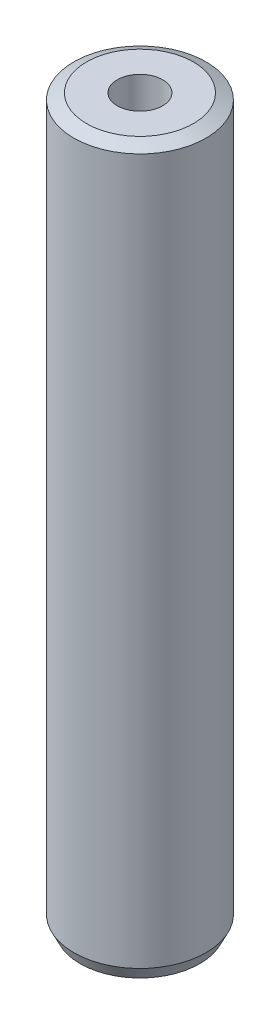
ISO-10303-21;
HEADER;
FILE_DESCRIPTION(('STEP AP214'),'2;1');
FILE_NAME('part.step','',(''),(''),'','','');
FILE_SCHEMA(('AUTOMOTIVE_DESIGN { 1 0 10303 214 1 1 1 1 }'));
ENDSEC;
DATA;
#1=APPLICATION_CONTEXT('core data for automotive mechanical design processes');
#2=APPLICATION_PROTOCOL_DEFINITION('international standard','automotive_design',2000,#1);
#3=PRODUCT_CONTEXT('',#1,'mechanical');
#4=PRODUCT('Part','Part','',(#3));
#5=PRODUCT_RELATED_PRODUCT_CATEGORY('part','',(#4));
#6=PRODUCT_DEFINITION_FORMATION('','',#4);
#7=PRODUCT_DEFINITION_CONTEXT('part definition',#1,'design');
#8=PRODUCT_DEFINITION('design','',#6,#7);
#9=PRODUCT_DEFINITION_SHAPE('','',#8);
#10=(LENGTH_UNIT() NAMED_UNIT(*) SI_UNIT(.MILLI.,.METRE.));
#11=(NAMED_UNIT(*) PLANE_ANGLE_UNIT() SI_UNIT($,.RADIAN.));
#12=(NAMED_UNIT(*) SI_UNIT($,.STERADIAN.) SOLID_ANGLE_UNIT());
#13=UNCERTAINTY_MEASURE_WITH_UNIT(LENGTH_MEASURE(1.E-05),#10,'distance_accuracy_value','');
#14=(GEOMETRIC_REPRESENTATION_CONTEXT(3) GLOBAL_UNCERTAINTY_ASSIGNED_CONTEXT((#13)) GLOBAL_UNIT_ASSIGNED_CONTEXT((#10,
#11,#12)) REPRESENTATION_CONTEXT('',''));
#15=CARTESIAN_POINT('',(0.,0.,0.));
#16=DIRECTION('',(0.,0.,1.));
#17=DIRECTION('',(1.,0.,0.));
#18=AXIS2_PLACEMENT_3D('',#15,#16,#17);
#19=CARTESIAN_POINT('',(0.,328.68732032117,0.));
#20=DIRECTION('',(0.,-1.,0.));
#21=DIRECTION('',(0.,0.,-1.));
#22=AXIS2_PLACEMENT_3D('',#19,#20,#21);
#23=CYLINDRICAL_SURFACE('',#22,30.);
#24=CARTESIAN_POINT('',(0.,325.855722824461,0.));
#25=DIRECTION('',(0.,1.,0.));
#26=DIRECTION('',(0.,0.,1.));
#27=AXIS2_PLACEMENT_3D('',#24,#25,#26);
#28=CIRCLE('',#27,30.);
#29=CARTESIAN_POINT('',(0.,325.855722824461,30.));
#30=VERTEX_POINT('',#29);
#31=EDGE_CURVE('E50',#30,#30,#28,.F.);
#32=ORIENTED_EDGE('',*,*,#31,.T.);
#33=EDGE_LOOP('',(#32));
#34=FACE_BOUND('',#33,.T.);
#35=CARTESIAN_POINT('',(0.,5.75270222064295,0.));
#36=DIRECTION('',(0.,1.,0.));
#37=DIRECTION('',(0.,0.,1.));
#38=AXIS2_PLACEMENT_3D('',#35,#36,#37);
#39=CIRCLE('',#38,30.);
#40=CARTESIAN_POINT('',(0.,5.75270222064295,30.));
#41=VERTEX_POINT('',#40);
#42=EDGE_CURVE('E51',#41,#41,#39,.T.);
#43=ORIENTED_EDGE('',*,*,#42,.T.);
#44=EDGE_LOOP('',(#43));
#45=FACE_BOUND('',#44,.T.);
#46=ADVANCED_FACE('F39',(#34,#45),#23,.T.);
#47=CARTESIAN_POINT('',(0.,328.68732032117,0.));
#48=DIRECTION('',(0.,1.,0.));
#49=DIRECTION('',(0.,0.,1.));
#50=AXIS2_PLACEMENT_3D('',#47,#48,#49);
#51=PLANE('',#50);
#52=CARTESIAN_POINT('',(0.,328.68732032117,0.));
#53=DIRECTION('',(0.,1.,0.));
#54=DIRECTION('',(0.,0.,1.));
#55=AXIS2_PLACEMENT_3D('',#52,#53,#54);
#56=CIRCLE('',#55,24.2472977793567);
#57=CARTESIAN_POINT('',(0.,328.68732032117,24.2472977793567));
#58=VERTEX_POINT('',#57);
#59=EDGE_CURVE('E54',#58,#58,#56,.T.);
#60=ORIENTED_EDGE('',*,*,#59,.T.);
#61=EDGE_LOOP('',(#60));
#62=FACE_BOUND('',#61,.T.);
#63=CARTESIAN_POINT('',(0.,328.68732032117,0.));
#64=DIRECTION('',(0.,1.,0.));
#65=DIRECTION('',(0.,0.,1.));
#66=AXIS2_PLACEMENT_3D('',#63,#64,#65);
#67=CIRCLE('',#66,10.2740765164107);
#68=CARTESIAN_POINT('',(0.,328.68732032117,10.2740765164107));
#69=VERTEX_POINT('',#68);
#70=EDGE_CURVE('E58',#69,#69,#67,.T.);
#71=ORIENTED_EDGE('',*,*,#70,.F.);
#72=EDGE_LOOP('',(#71));
#73=FACE_BOUND('',#72,.T.);
#74=ADVANCED_FACE('F69',(#62,#73),#51,.T.);
#75=CARTESIAN_POINT('',(0.,0.,0.));
#76=DIRECTION('',(0.,1.,0.));
#77=DIRECTION('',(0.,0.,1.));
#78=AXIS2_PLACEMENT_3D('',#75,#76,#77);
#79=PLANE('',#78);
#80=CARTESIAN_POINT('',(0.,0.,0.));
#81=DIRECTION('',(0.,1.,0.));
#82=DIRECTION('',(0.,0.,1.));
#83=AXIS2_PLACEMENT_3D('',#80,#81,#82);
#84=CIRCLE('',#83,27.1684025032907);
#85=CARTESIAN_POINT('',(0.,0.,27.1684025032907));
#86=VERTEX_POINT('',#85);
#87=EDGE_CURVE('E10',#86,#86,#84,.F.);
#88=ORIENTED_EDGE('',*,*,#87,.T.);
#89=EDGE_LOOP('',(#88));
#90=FACE_BOUND('',#89,.T.);
#91=CARTESIAN_POINT('',(0.,0.,0.));
#92=DIRECTION('',(0.,1.,0.));
#93=DIRECTION('',(0.,0.,1.));
#94=AXIS2_PLACEMENT_3D('',#91,#92,#93);
#95=CIRCLE('',#94,10.2740765164107);
#96=CARTESIAN_POINT('',(0.,0.,10.2740765164107));
#97=VERTEX_POINT('',#96);
#98=EDGE_CURVE('E63',#97,#97,#95,.T.);
#99=ORIENTED_EDGE('',*,*,#98,.T.);
#100=EDGE_LOOP('',(#99));
#101=FACE_BOUND('',#100,.T.);
#102=ADVANCED_FACE('F75',(#90,#101),#79,.F.);
#103=CARTESIAN_POINT('',(0.,328.68732032117,0.));
#104=DIRECTION('',(0.,-1.,0.));
#105=DIRECTION('',(0.,0.,-1.));
#106=AXIS2_PLACEMENT_3D('',#103,#104,#105);
#107=CYLINDRICAL_SURFACE('',#106,10.2740765164107);
#108=ORIENTED_EDGE('',*,*,#70,.T.);
#109=EDGE_LOOP('',(#108));
#110=FACE_BOUND('',#109,.T.);
#111=ORIENTED_EDGE('',*,*,#98,.F.);
#112=EDGE_LOOP('',(#111));
#113=FACE_BOUND('',#112,.T.);
#114=ADVANCED_FACE('F70',(#110,#113),#107,.F.);
#115=CARTESIAN_POINT('',(0.,328.68732032117,0.));
#116=DIRECTION('',(0.,-1.,0.));
#117=DIRECTION('',(0.,0.,-1.));
#118=AXIS2_PLACEMENT_3D('',#115,#116,#117);
#119=CONICAL_SURFACE('',#118,24.2472977793567,1.11339172904252);
#120=ORIENTED_EDGE('',*,*,#31,.F.);
#121=EDGE_LOOP('',(#120));
#122=FACE_BOUND('',#121,.T.);
#123=ORIENTED_EDGE('',*,*,#59,.F.);
#124=EDGE_LOOP('',(#123));
#125=FACE_BOUND('',#124,.T.);
#126=ADVANCED_FACE('F81',(#122,#125),#119,.T.);
#127=CARTESIAN_POINT('',(0.,5.75270222064295,0.));
#128=DIRECTION('',(0.,1.,0.));
#129=DIRECTION('',(0.,0.,1.));
#130=AXIS2_PLACEMENT_3D('',#127,#128,#129);
#131=CONICAL_SURFACE('',#130,30.,0.457404597752382);
#132=CARTESIAN_POINT('',(0.,0.,27.1684025032907));
#133=CARTESIAN_POINT('',(0.,0.0599239814650306,27.1978983105481));
#134=CARTESIAN_POINT('',(0.,0.119847962930061,27.2273941178055));
#135=CARTESIAN_POINT('',(0.,0.239695925860122,27.2863857323202));
#136=CARTESIAN_POINT('',(0.,0.299619907325152,27.3158815395776));
#137=CARTESIAN_POINT('',(0.,0.419467870255214,27.3748731540924));
#138=CARTESIAN_POINT('',(0.,0.479391851720245,27.4043689613498));
#139=CARTESIAN_POINT('',(0.,0.599239814650306,27.4633605758646));
#140=CARTESIAN_POINT('',(0.,0.659163796115337,27.492856383122));
#141=CARTESIAN_POINT('',(0.,0.779011759045398,27.5518479976367));
#142=CARTESIAN_POINT('',(0.,0.838935740510429,27.5813438048941));
#143=CARTESIAN_POINT('',(0.,0.95878370344049,27.6403354194089));
#144=CARTESIAN_POINT('',(0.,1.01870768490552,27.6698312266663));
#145=CARTESIAN_POINT('',(0.,1.13855564783558,27.7288228411811));
#146=CARTESIAN_POINT('',(0.,1.19847962930061,27.7583186484385));
#147=CARTESIAN_POINT('',(0.,1.31832759223067,27.8173102629532));
#148=CARTESIAN_POINT('',(0.,1.3782515736957,27.8468060702106));
#149=CARTESIAN_POINT('',(0.,1.49809953662577,27.9057976847254));
#150=CARTESIAN_POINT('',(0.,1.5580235180908,27.9352934919828));
#151=CARTESIAN_POINT('',(0.,1.67787148102086,27.9942851064976));
#152=CARTESIAN_POINT('',(0.,1.73779546248589,28.023780913755));
#153=CARTESIAN_POINT('',(0.,1.85764342541595,28.0827725282697));
#154=CARTESIAN_POINT('',(0.,1.91756740688098,28.1122683355271));
#155=CARTESIAN_POINT('',(0.,2.03741536981104,28.1712599500419));
#156=CARTESIAN_POINT('',(0.,2.09733935127607,28.2007557572993));
#157=CARTESIAN_POINT('',(0.,2.21718731420614,28.2597473718141));
#158=CARTESIAN_POINT('',(0.,2.27711129567117,28.2892431790715));
#159=CARTESIAN_POINT('',(0.,2.39695925860123,28.3482347935862));
#160=CARTESIAN_POINT('',(0.,2.45688324006626,28.3777306008436));
#161=CARTESIAN_POINT('',(0.,2.57673120299632,28.4367222153584));
#162=CARTESIAN_POINT('',(0.,2.63665518446135,28.4662180226158));
#163=CARTESIAN_POINT('',(0.,2.75650314739141,28.5252096371306));
#164=CARTESIAN_POINT('',(0.,2.81642712885644,28.554705444388));
#165=CARTESIAN_POINT('',(0.,2.9362750917865,28.6136970589027));
#166=CARTESIAN_POINT('',(0.,2.99619907325153,28.6431928661601));
#167=CARTESIAN_POINT('',(0.,3.1160470361816,28.7021844806749));
#168=CARTESIAN_POINT('',(0.,3.17597101764663,28.7316802879323));
#169=CARTESIAN_POINT('',(0.,3.29581898057669,28.7906719024471));
#170=CARTESIAN_POINT('',(0.,3.35574296204172,28.8201677097045));
#171=CARTESIAN_POINT('',(0.,3.47559092497178,28.8791593242192));
#172=CARTESIAN_POINT('',(0.,3.53551490643681,28.9086551314766));
#173=CARTESIAN_POINT('',(0.,3.65536286936687,28.9676467459914));
#174=CARTESIAN_POINT('',(0.,3.7152868508319,28.9971425532488));
#175=CARTESIAN_POINT('',(0.,3.83513481376196,29.0561341677636));
#176=CARTESIAN_POINT('',(0.,3.89505879522699,29.0856299750209));
#177=CARTESIAN_POINT('',(0.,4.01490675815706,29.1446215895357));
#178=CARTESIAN_POINT('',(0.,4.07483073962209,29.1741173967931));
#179=CARTESIAN_POINT('',(0.,4.19467870255215,29.2331090113079));
#180=CARTESIAN_POINT('',(0.,4.25460268401718,29.2626048185653));
#181=CARTESIAN_POINT('',(0.,4.37445064694724,29.3215964330801));
#182=CARTESIAN_POINT('',(0.,4.43437462841227,29.3510922403374));
#183=CARTESIAN_POINT('',(0.,4.55422259134233,29.4100838548522));
#184=CARTESIAN_POINT('',(0.,4.61414657280736,29.4395796621096));
#185=CARTESIAN_POINT('',(0.,4.73399453573743,29.4985712766244));
#186=CARTESIAN_POINT('',(0.,4.79391851720246,29.5280670838818));
#187=CARTESIAN_POINT('',(0.,4.91376648013252,29.5870586983966));
#188=CARTESIAN_POINT('',(0.,4.97369046159755,29.6165545056539));
#189=CARTESIAN_POINT('',(0.,5.09353842452761,29.6755461201687));
#190=CARTESIAN_POINT('',(0.,5.15346240599264,29.7050419274261));
#191=CARTESIAN_POINT('',(0.,5.2733103689227,29.7640335419409));
#192=CARTESIAN_POINT('',(0.,5.33323435038773,29.7935293491983));
#193=CARTESIAN_POINT('',(0.,5.45308231331779,29.8525209637131));
#194=CARTESIAN_POINT('',(0.,5.51300629478282,29.8820167709704));
#195=CARTESIAN_POINT('',(0.,5.63285425771289,29.9410083854852));
#196=CARTESIAN_POINT('',(0.,5.69277823917792,29.9705041927426));
#197=CARTESIAN_POINT('',(0.,5.75270222064295,30.));
#198=B_SPLINE_CURVE_WITH_KNOTS('',3,(#132,#133,#134,#135,#136,#137,#138,#139,#140,#141,#142,
#143,#144,#145,#146,#147,#148,#149,#150,#151,#152,#153,#154,#155,#156,#157,#158,#159,#160,#161,
#162,#163,#164,#165,#166,#167,#168,#169,#170,#171,#172,#173,#174,#175,#176,#177,#178,#179,#180,
#181,#182,#183,#184,#185,#186,#187,#188,#189,#190,#191,#192,#193,#194,#195,#196,#197),
.UNSPECIFIED.,.F.,.F.,(4,2,2,2,2,2,2,2,2,2,2,2,2,2,2,2,2,2,2,2,2,2,2,2,2,2,2,2,2,2,2,2,4),(0.,
0.200369598001985,0.400739196003971,0.601108794005956,0.801478392007942,1.00184799000993,
1.20221758801191,1.4025871860139,1.60295678401588,1.80332638201787,2.00369598001986,
2.20406557802184,2.40443517602383,2.60480477402581,2.8051743720278,3.00554397002978,
3.20591356803177,3.40628316603375,3.60665276403574,3.80702236203773,4.00739196003971,
4.2077615580417,4.40813115604368,4.60850075404567,4.80887035204765,5.00923995004964,
5.20960954805162,5.40997914605361,5.6103487440556,5.81071834205758,6.01108794005957,
6.21145753806155,6.41182713606354),.UNSPECIFIED.);
#199=EDGE_CURVE('BSEAM45',#86,#41,#198,.T.);
#200=ORIENTED_EDGE('',*,*,#87,.F.);
#201=ORIENTED_EDGE('',*,*,#42,.F.);
#202=ORIENTED_EDGE('',*,*,#199,.T.);
#203=ORIENTED_EDGE('',*,*,#199,.F.);
#204=EDGE_LOOP('',(#200,#202,#201,#203));
#205=FACE_BOUND('',#204,.T.);
#206=ADVANCED_FACE('F45',(#205),#131,.T.);
#207=CLOSED_SHELL('',(#46,#74,#102,#114,#126,#206));
#208=MANIFOLD_SOLID_BREP('B2',#207);
#209=ADVANCED_BREP_SHAPE_REPRESENTATION('',(#18,#208),#14);
#210=SHAPE_DEFINITION_REPRESENTATION(#9,#209);
ENDSEC;
END-ISO-10303-21;
